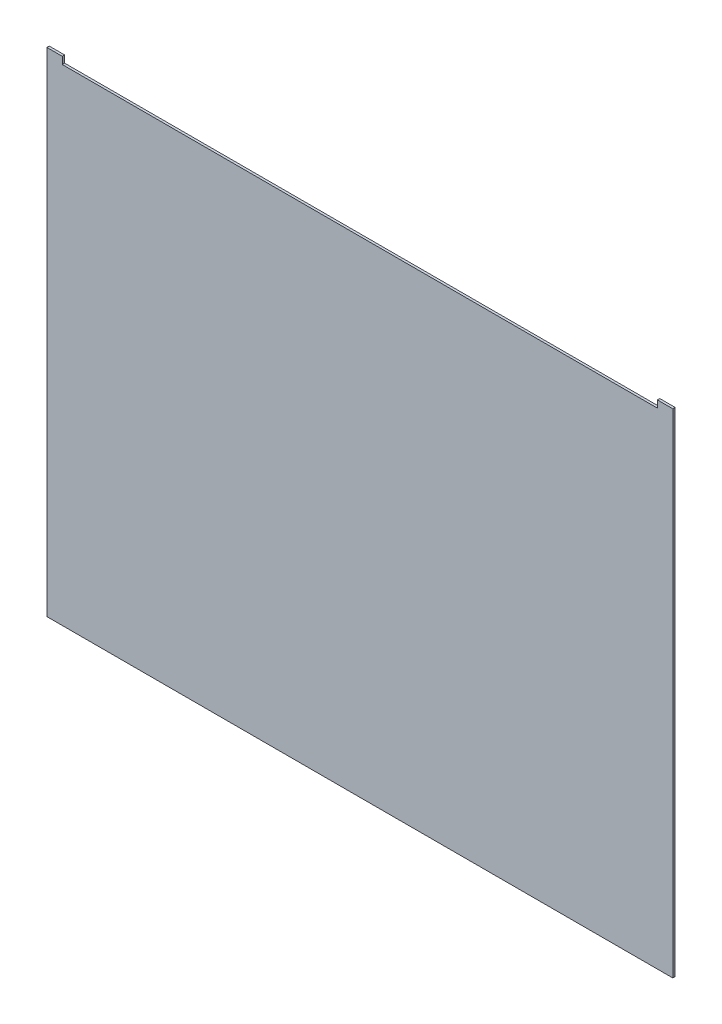
ISO-10303-21;
HEADER;
FILE_DESCRIPTION(('STEP AP214'),'2;1');
FILE_NAME('part.step','',(''),(''),'','','');
FILE_SCHEMA(('AUTOMOTIVE_DESIGN { 1 0 10303 214 1 1 1 1 }'));
ENDSEC;
DATA;
#1=APPLICATION_CONTEXT('core data for automotive mechanical design processes');
#2=APPLICATION_PROTOCOL_DEFINITION('international standard','automotive_design',2000,#1);
#3=PRODUCT_CONTEXT('',#1,'mechanical');
#4=PRODUCT('Part','Part','',(#3));
#5=PRODUCT_RELATED_PRODUCT_CATEGORY('part','',(#4));
#6=PRODUCT_DEFINITION_FORMATION('','',#4);
#7=PRODUCT_DEFINITION_CONTEXT('part definition',#1,'design');
#8=PRODUCT_DEFINITION('design','',#6,#7);
#9=PRODUCT_DEFINITION_SHAPE('','',#8);
#10=(LENGTH_UNIT() NAMED_UNIT(*) SI_UNIT(.MILLI.,.METRE.));
#11=(NAMED_UNIT(*) PLANE_ANGLE_UNIT() SI_UNIT($,.RADIAN.));
#12=(NAMED_UNIT(*) SI_UNIT($,.STERADIAN.) SOLID_ANGLE_UNIT());
#13=UNCERTAINTY_MEASURE_WITH_UNIT(LENGTH_MEASURE(1.E-05),#10,'distance_accuracy_value','');
#14=(GEOMETRIC_REPRESENTATION_CONTEXT(3) GLOBAL_UNCERTAINTY_ASSIGNED_CONTEXT((#13)) GLOBAL_UNIT_ASSIGNED_CONTEXT((#10,
#11,#12)) REPRESENTATION_CONTEXT('',''));
#15=CARTESIAN_POINT('',(0.,0.,0.));
#16=DIRECTION('',(0.,0.,1.));
#17=DIRECTION('',(1.,0.,0.));
#18=AXIS2_PLACEMENT_3D('',#15,#16,#17);
#19=CARTESIAN_POINT('',(0.,415.,0.));
#20=DIRECTION('',(0.,-1.,0.));
#21=DIRECTION('',(-1.,0.,0.));
#22=AXIS2_PLACEMENT_3D('',#19,#20,#21);
#23=PLANE('',#22);
#24=DIRECTION('',(1.,0.,0.));
#25=VECTOR('',#24,1.);
#26=CARTESIAN_POINT('',(-263.5,415.,780.732828821742));
#27=LINE('',#26,#25);
#28=CARTESIAN_POINT('',(-263.5,415.,780.732828821742));
#29=VERTEX_POINT('',#28);
#30=CARTESIAN_POINT('',(-250.500000000001,415.,780.732828821742));
#31=VERTEX_POINT('',#30);
#32=EDGE_CURVE('E148',#29,#31,#27,.T.);
#33=ORIENTED_EDGE('',*,*,#32,.T.);
#34=DIRECTION('',(0.,0.,-1.));
#35=VECTOR('',#34,1.);
#36=CARTESIAN_POINT('',(-250.500000000001,415.,0.));
#37=LINE('',#36,#35);
#38=CARTESIAN_POINT('',(-250.500000000001,415.,778.732828821742));
#39=VERTEX_POINT('',#38);
#40=EDGE_CURVE('E49',#31,#39,#37,.T.);
#41=ORIENTED_EDGE('',*,*,#40,.T.);
#42=DIRECTION('',(1.,0.,0.));
#43=VECTOR('',#42,1.);
#44=CARTESIAN_POINT('',(-263.5,415.,778.732828821742));
#45=LINE('',#44,#43);
#46=CARTESIAN_POINT('',(-263.5,415.,778.732828821742));
#47=VERTEX_POINT('',#46);
#48=EDGE_CURVE('E156',#47,#39,#45,.T.);
#49=ORIENTED_EDGE('',*,*,#48,.F.);
#50=DIRECTION('',(0.,0.,-1.));
#51=VECTOR('',#50,1.);
#52=CARTESIAN_POINT('',(-263.5,415.,780.732828821742));
#53=LINE('',#52,#51);
#54=EDGE_CURVE('E160',#29,#47,#53,.T.);
#55=ORIENTED_EDGE('',*,*,#54,.F.);
#56=EDGE_LOOP('',(#33,#41,#49,#55));
#57=FACE_BOUND('',#56,.T.);
#58=ADVANCED_FACE('F40',(#57),#23,.F.);
#59=CARTESIAN_POINT('',(-263.5,415.,780.732828821742));
#60=DIRECTION('',(0.,0.,-1.));
#61=DIRECTION('',(-1.,0.,0.));
#62=AXIS2_PLACEMENT_3D('',#59,#60,#61);
#63=PLANE('',#62);
#64=DIRECTION('',(1.,0.,0.));
#65=VECTOR('',#64,1.);
#66=CARTESIAN_POINT('',(250.499999999999,409.,780.732828821742));
#67=LINE('',#66,#65);
#68=CARTESIAN_POINT('',(-250.500000000001,409.,780.732828821742));
#69=VERTEX_POINT('',#68);
#70=CARTESIAN_POINT('',(250.499999999999,409.,780.732828821742));
#71=VERTEX_POINT('',#70);
#72=EDGE_CURVE('E119',#69,#71,#67,.T.);
#73=ORIENTED_EDGE('',*,*,#72,.F.);
#74=DIRECTION('',(0.,-1.,0.));
#75=VECTOR('',#74,1.);
#76=CARTESIAN_POINT('',(-250.500000000001,409.,780.732828821742));
#77=LINE('',#76,#75);
#78=EDGE_CURVE('E127',#31,#69,#77,.T.);
#79=ORIENTED_EDGE('',*,*,#78,.F.);
#80=ORIENTED_EDGE('',*,*,#32,.F.);
#81=DIRECTION('',(0.,-1.,0.));
#82=VECTOR('',#81,1.);
#83=CARTESIAN_POINT('',(-263.5,415.,780.732828821742));
#84=LINE('',#83,#82);
#85=CARTESIAN_POINT('',(-263.5,0.,780.732828821742));
#86=VERTEX_POINT('',#85);
#87=EDGE_CURVE('E65',#29,#86,#84,.T.);
#88=ORIENTED_EDGE('',*,*,#87,.T.);
#89=DIRECTION('',(1.,0.,0.));
#90=VECTOR('',#89,1.);
#91=CARTESIAN_POINT('',(-263.5,0.,780.732828821742));
#92=LINE('',#91,#90);
#93=CARTESIAN_POINT('',(263.5,0.,780.732828821742));
#94=VERTEX_POINT('',#93);
#95=EDGE_CURVE('E147',#86,#94,#92,.T.);
#96=ORIENTED_EDGE('',*,*,#95,.T.);
#97=DIRECTION('',(0.,-1.,0.));
#98=VECTOR('',#97,1.);
#99=CARTESIAN_POINT('',(263.5,415.,780.732828821742));
#100=LINE('',#99,#98);
#101=CARTESIAN_POINT('',(263.5,415.,780.732828821742));
#102=VERTEX_POINT('',#101);
#103=EDGE_CURVE('E185',#102,#94,#100,.T.);
#104=ORIENTED_EDGE('',*,*,#103,.F.);
#105=CARTESIAN_POINT('',(250.499999999999,415.,780.732828821742));
#106=VERTEX_POINT('',#105);
#107=EDGE_CURVE('E91',#106,#102,#27,.T.);
#108=ORIENTED_EDGE('',*,*,#107,.F.);
#109=DIRECTION('',(0.,1.,0.));
#110=VECTOR('',#109,1.);
#111=CARTESIAN_POINT('',(250.499999999999,409.,780.732828821742));
#112=LINE('',#111,#110);
#113=EDGE_CURVE('E56',#71,#106,#112,.T.);
#114=ORIENTED_EDGE('',*,*,#113,.F.);
#115=EDGE_LOOP('',(#73,#79,#80,#88,#96,#104,#108,#114));
#116=FACE_BOUND('',#115,.T.);
#117=ADVANCED_FACE('F42',(#116),#63,.F.);
#118=CARTESIAN_POINT('',(263.5,415.,778.732828821742));
#119=DIRECTION('',(1.,0.,0.));
#120=DIRECTION('',(0.,0.,-1.));
#121=AXIS2_PLACEMENT_3D('',#118,#119,#120);
#122=PLANE('',#121);
#123=DIRECTION('',(0.,0.,1.));
#124=VECTOR('',#123,1.);
#125=CARTESIAN_POINT('',(263.5,0.,778.732828821742));
#126=LINE('',#125,#124);
#127=CARTESIAN_POINT('',(263.5,0.,778.732828821742));
#128=VERTEX_POINT('',#127);
#129=EDGE_CURVE('E165',#128,#94,#126,.T.);
#130=ORIENTED_EDGE('',*,*,#129,.F.);
#131=DIRECTION('',(0.,-1.,0.));
#132=VECTOR('',#131,1.);
#133=CARTESIAN_POINT('',(263.5,415.,778.732828821742));
#134=LINE('',#133,#132);
#135=CARTESIAN_POINT('',(263.5,415.,778.732828821742));
#136=VERTEX_POINT('',#135);
#137=EDGE_CURVE('E182',#136,#128,#134,.T.);
#138=ORIENTED_EDGE('',*,*,#137,.F.);
#139=DIRECTION('',(0.,0.,1.));
#140=VECTOR('',#139,1.);
#141=CARTESIAN_POINT('',(263.5,415.,778.732828821742));
#142=LINE('',#141,#140);
#143=EDGE_CURVE('E151',#136,#102,#142,.T.);
#144=ORIENTED_EDGE('',*,*,#143,.T.);
#145=ORIENTED_EDGE('',*,*,#103,.T.);
#146=EDGE_LOOP('',(#130,#138,#144,#145));
#147=FACE_BOUND('',#146,.T.);
#148=ADVANCED_FACE('F205',(#147),#122,.T.);
#149=CARTESIAN_POINT('',(-263.5,415.,778.732828821742));
#150=DIRECTION('',(0.,0.,-1.));
#151=DIRECTION('',(-1.,0.,0.));
#152=AXIS2_PLACEMENT_3D('',#149,#150,#151);
#153=PLANE('',#152);
#154=DIRECTION('',(0.,1.,0.));
#155=VECTOR('',#154,1.);
#156=CARTESIAN_POINT('',(-250.500000000001,415.,778.732828821742));
#157=LINE('',#156,#155);
#158=CARTESIAN_POINT('',(-250.500000000001,409.,778.732828821742));
#159=VERTEX_POINT('',#158);
#160=EDGE_CURVE('E144',#159,#39,#157,.T.);
#161=ORIENTED_EDGE('',*,*,#160,.F.);
#162=DIRECTION('',(-1.,0.,0.));
#163=VECTOR('',#162,1.);
#164=CARTESIAN_POINT('',(-263.5,409.,778.732828821742));
#165=LINE('',#164,#163);
#166=CARTESIAN_POINT('',(250.499999999999,409.,778.732828821742));
#167=VERTEX_POINT('',#166);
#168=EDGE_CURVE('E11',#167,#159,#165,.T.);
#169=ORIENTED_EDGE('',*,*,#168,.F.);
#170=DIRECTION('',(0.,-1.,0.));
#171=VECTOR('',#170,1.);
#172=CARTESIAN_POINT('',(250.499999999999,415.,778.732828821742));
#173=LINE('',#172,#171);
#174=CARTESIAN_POINT('',(250.499999999999,415.,778.732828821742));
#175=VERTEX_POINT('',#174);
#176=EDGE_CURVE('E140',#175,#167,#173,.T.);
#177=ORIENTED_EDGE('',*,*,#176,.F.);
#178=EDGE_CURVE('E155',#175,#136,#45,.T.);
#179=ORIENTED_EDGE('',*,*,#178,.T.);
#180=ORIENTED_EDGE('',*,*,#137,.T.);
#181=DIRECTION('',(1.,0.,0.));
#182=VECTOR('',#181,1.);
#183=CARTESIAN_POINT('',(-263.5,0.,778.732828821742));
#184=LINE('',#183,#182);
#185=CARTESIAN_POINT('',(-263.5,0.,778.732828821742));
#186=VERTEX_POINT('',#185);
#187=EDGE_CURVE('E169',#186,#128,#184,.T.);
#188=ORIENTED_EDGE('',*,*,#187,.F.);
#189=DIRECTION('',(0.,-1.,0.));
#190=VECTOR('',#189,1.);
#191=CARTESIAN_POINT('',(-263.5,415.,778.732828821742));
#192=LINE('',#191,#190);
#193=EDGE_CURVE('E179',#47,#186,#192,.T.);
#194=ORIENTED_EDGE('',*,*,#193,.F.);
#195=ORIENTED_EDGE('',*,*,#48,.T.);
#196=EDGE_LOOP('',(#161,#169,#177,#179,#180,#188,#194,#195));
#197=FACE_BOUND('',#196,.T.);
#198=ADVANCED_FACE('F197',(#197),#153,.T.);
#199=CARTESIAN_POINT('',(-263.5,415.,780.732828821742));
#200=DIRECTION('',(-1.,0.,0.));
#201=DIRECTION('',(0.,0.,1.));
#202=AXIS2_PLACEMENT_3D('',#199,#200,#201);
#203=PLANE('',#202);
#204=DIRECTION('',(0.,0.,-1.));
#205=VECTOR('',#204,1.);
#206=CARTESIAN_POINT('',(-263.5,0.,780.732828821742));
#207=LINE('',#206,#205);
#208=EDGE_CURVE('E173',#86,#186,#207,.T.);
#209=ORIENTED_EDGE('',*,*,#208,.F.);
#210=ORIENTED_EDGE('',*,*,#87,.F.);
#211=ORIENTED_EDGE('',*,*,#54,.T.);
#212=ORIENTED_EDGE('',*,*,#193,.T.);
#213=EDGE_LOOP('',(#209,#210,#211,#212));
#214=FACE_BOUND('',#213,.T.);
#215=ADVANCED_FACE('F199',(#214),#203,.T.);
#216=ORIENTED_EDGE('',*,*,#178,.F.);
#217=DIRECTION('',(0.,0.,1.));
#218=VECTOR('',#217,1.);
#219=CARTESIAN_POINT('',(250.499999999999,415.,0.));
#220=LINE('',#219,#218);
#221=EDGE_CURVE('E188',#175,#106,#220,.T.);
#222=ORIENTED_EDGE('',*,*,#221,.T.);
#223=ORIENTED_EDGE('',*,*,#107,.T.);
#224=ORIENTED_EDGE('',*,*,#143,.F.);
#225=EDGE_LOOP('',(#216,#222,#223,#224));
#226=FACE_BOUND('',#225,.T.);
#227=ADVANCED_FACE('F207',(#226),#23,.F.);
#228=CARTESIAN_POINT('',(0.,0.,0.));
#229=DIRECTION('',(0.,-1.,0.));
#230=DIRECTION('',(-1.,0.,0.));
#231=AXIS2_PLACEMENT_3D('',#228,#229,#230);
#232=PLANE('',#231);
#233=ORIENTED_EDGE('',*,*,#95,.F.);
#234=ORIENTED_EDGE('',*,*,#208,.T.);
#235=ORIENTED_EDGE('',*,*,#187,.T.);
#236=ORIENTED_EDGE('',*,*,#129,.T.);
#237=EDGE_LOOP('',(#233,#234,#235,#236));
#238=FACE_BOUND('',#237,.T.);
#239=ADVANCED_FACE('F201',(#238),#232,.T.);
#240=CARTESIAN_POINT('',(-250.500000000001,409.,777.732828821742));
#241=DIRECTION('',(-1.,0.,0.));
#242=DIRECTION('',(0.,0.,1.));
#243=AXIS2_PLACEMENT_3D('',#240,#241,#242);
#244=PLANE('',#243);
#245=ORIENTED_EDGE('',*,*,#160,.T.);
#246=ORIENTED_EDGE('',*,*,#40,.F.);
#247=ORIENTED_EDGE('',*,*,#78,.T.);
#248=DIRECTION('',(0.,0.,1.));
#249=VECTOR('',#248,1.);
#250=CARTESIAN_POINT('',(-250.500000000001,409.,777.732828821742));
#251=LINE('',#250,#249);
#252=EDGE_CURVE('E114',#159,#69,#251,.T.);
#253=ORIENTED_EDGE('',*,*,#252,.F.);
#254=EDGE_LOOP('',(#245,#246,#247,#253));
#255=FACE_BOUND('',#254,.T.);
#256=ADVANCED_FACE('F128',(#255),#244,.F.);
#257=CARTESIAN_POINT('',(250.499999999999,409.,777.732828821742));
#258=DIRECTION('',(1.,0.,0.));
#259=DIRECTION('',(0.,0.,-1.));
#260=AXIS2_PLACEMENT_3D('',#257,#258,#259);
#261=PLANE('',#260);
#262=ORIENTED_EDGE('',*,*,#176,.T.);
#263=DIRECTION('',(0.,0.,1.));
#264=VECTOR('',#263,1.);
#265=CARTESIAN_POINT('',(250.499999999999,409.,777.732828821742));
#266=LINE('',#265,#264);
#267=EDGE_CURVE('E124',#167,#71,#266,.T.);
#268=ORIENTED_EDGE('',*,*,#267,.T.);
#269=ORIENTED_EDGE('',*,*,#113,.T.);
#270=ORIENTED_EDGE('',*,*,#221,.F.);
#271=EDGE_LOOP('',(#262,#268,#269,#270));
#272=FACE_BOUND('',#271,.T.);
#273=ADVANCED_FACE('F212',(#272),#261,.F.);
#274=CARTESIAN_POINT('',(250.499999999999,409.,777.732828821742));
#275=DIRECTION('',(0.,-1.,0.));
#276=DIRECTION('',(1.,0.,0.));
#277=AXIS2_PLACEMENT_3D('',#274,#275,#276);
#278=PLANE('',#277);
#279=ORIENTED_EDGE('',*,*,#168,.T.);
#280=ORIENTED_EDGE('',*,*,#252,.T.);
#281=ORIENTED_EDGE('',*,*,#72,.T.);
#282=ORIENTED_EDGE('',*,*,#267,.F.);
#283=EDGE_LOOP('',(#279,#280,#281,#282));
#284=FACE_BOUND('',#283,.T.);
#285=ADVANCED_FACE('F116',(#284),#278,.F.);
#286=CLOSED_SHELL('',(#58,#117,#148,#198,#215,#227,#239,#256,#273,#285));
#287=MANIFOLD_SOLID_BREP('B2',#286);
#288=ADVANCED_BREP_SHAPE_REPRESENTATION('',(#18,#287),#14);
#289=SHAPE_DEFINITION_REPRESENTATION(#9,#288);
ENDSEC;
END-ISO-10303-21;
